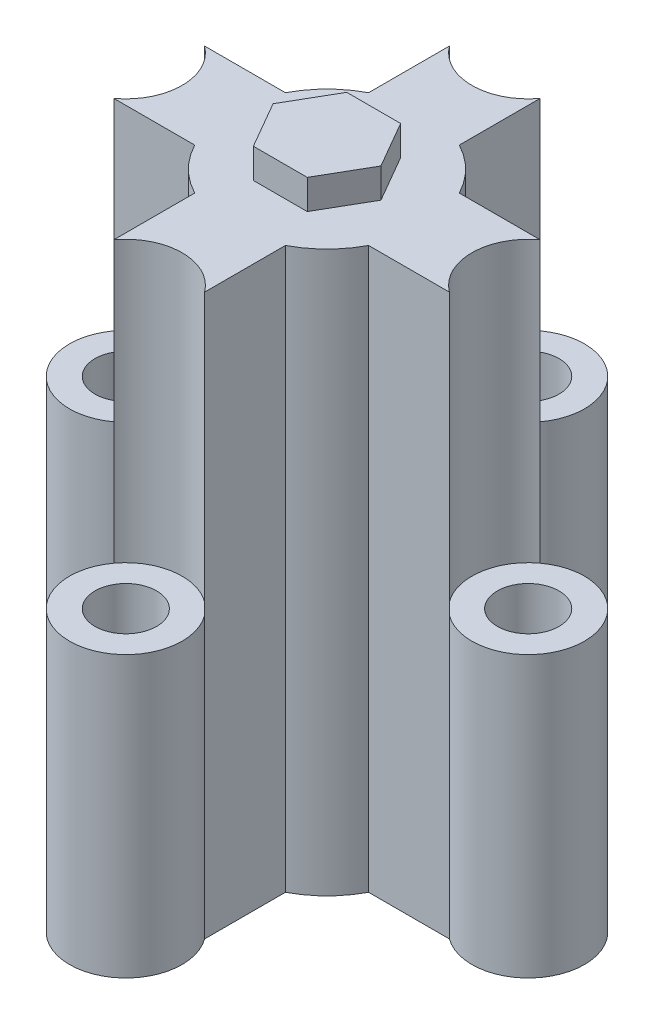
ISO-10303-21;
HEADER;
FILE_DESCRIPTION(('STEP AP214'),'2;1');
FILE_NAME('part.step','',(''),(''),'','','');
FILE_SCHEMA(('AUTOMOTIVE_DESIGN { 1 0 10303 214 1 1 1 1 }'));
ENDSEC;
DATA;
#1=APPLICATION_CONTEXT('core data for automotive mechanical design processes');
#2=APPLICATION_PROTOCOL_DEFINITION('international standard','automotive_design',2000,#1);
#3=PRODUCT_CONTEXT('',#1,'mechanical');
#4=PRODUCT('Part','Part','',(#3));
#5=PRODUCT_RELATED_PRODUCT_CATEGORY('part','',(#4));
#6=PRODUCT_DEFINITION_FORMATION('','',#4);
#7=PRODUCT_DEFINITION_CONTEXT('part definition',#1,'design');
#8=PRODUCT_DEFINITION('design','',#6,#7);
#9=PRODUCT_DEFINITION_SHAPE('','',#8);
#10=(LENGTH_UNIT() NAMED_UNIT(*) SI_UNIT(.MILLI.,.METRE.));
#11=(NAMED_UNIT(*) PLANE_ANGLE_UNIT() SI_UNIT($,.RADIAN.));
#12=(NAMED_UNIT(*) SI_UNIT($,.STERADIAN.) SOLID_ANGLE_UNIT());
#13=UNCERTAINTY_MEASURE_WITH_UNIT(LENGTH_MEASURE(1.E-05),#10,'distance_accuracy_value','');
#14=(GEOMETRIC_REPRESENTATION_CONTEXT(3) GLOBAL_UNCERTAINTY_ASSIGNED_CONTEXT((#13)) GLOBAL_UNIT_ASSIGNED_CONTEXT((#10,
#11,#12)) REPRESENTATION_CONTEXT('',''));
#15=CARTESIAN_POINT('',(0.,0.,0.));
#16=DIRECTION('',(0.,0.,1.));
#17=DIRECTION('',(1.,0.,0.));
#18=AXIS2_PLACEMENT_3D('',#15,#16,#17);
#19=CARTESIAN_POINT('',(-4.85829947999973,60.,0.));
#20=DIRECTION('',(1.,0.,0.));
#21=DIRECTION('',(0.,0.,-1.));
#22=AXIS2_PLACEMENT_3D('',#19,#20,#21);
#23=PLANE('',#22);
#24=DIRECTION('',(0.,0.,1.));
#25=VECTOR('',#24,1.);
#26=CARTESIAN_POINT('',(-4.85829947999973,0.,0.));
#27=LINE('',#26,#25);
#28=CARTESIAN_POINT('',(-4.85829947999973,0.,-17.9729348131197));
#29=VERTEX_POINT('',#28);
#30=CARTESIAN_POINT('',(-4.85829947999972,0.,-9.30843306698996));
#31=VERTEX_POINT('',#30);
#32=EDGE_CURVE('E403',#29,#31,#27,.T.);
#33=ORIENTED_EDGE('',*,*,#32,.T.);
#34=DIRECTION('',(0.,-1.,0.));
#35=VECTOR('',#34,1.);
#36=CARTESIAN_POINT('',(-4.85829947999972,60.,-9.30843306698996));
#37=LINE('',#36,#35);
#38=CARTESIAN_POINT('',(-4.85829947999972,60.,-9.30843306698996));
#39=VERTEX_POINT('',#38);
#40=EDGE_CURVE('E136',#39,#31,#37,.T.);
#41=ORIENTED_EDGE('',*,*,#40,.F.);
#42=DIRECTION('',(0.,0.,1.));
#43=VECTOR('',#42,1.);
#44=CARTESIAN_POINT('',(-4.85829947999973,60.,0.));
#45=LINE('',#44,#43);
#46=CARTESIAN_POINT('',(-4.85829947999973,60.,-17.9729348131197));
#47=VERTEX_POINT('',#46);
#48=EDGE_CURVE('E395',#47,#39,#45,.T.);
#49=ORIENTED_EDGE('',*,*,#48,.F.);
#50=DIRECTION('',(0.,-1.,0.));
#51=VECTOR('',#50,1.);
#52=CARTESIAN_POINT('',(-4.85829947999973,60.,-17.9729348131197));
#53=LINE('',#52,#51);
#54=CARTESIAN_POINT('',(-4.85829947999973,30.,-17.9729348131197));
#55=VERTEX_POINT('',#54);
#56=EDGE_CURVE('E12',#47,#55,#53,.T.);
#57=ORIENTED_EDGE('',*,*,#56,.T.);
#58=DIRECTION('',(0.,-1.,0.));
#59=VECTOR('',#58,1.);
#60=CARTESIAN_POINT('',(-4.85829947999973,30.,-17.9729348131197));
#61=LINE('',#60,#59);
#62=EDGE_CURVE('E374',#29,#55,#61,.F.);
#63=ORIENTED_EDGE('',*,*,#62,.F.);
#64=EDGE_LOOP('',(#33,#41,#49,#57,#63));
#65=FACE_BOUND('',#64,.T.);
#66=ADVANCED_FACE('F127',(#65),#23,.F.);
#67=CARTESIAN_POINT('',(4.85829948000028,60.,0.));
#68=DIRECTION('',(1.,0.,0.));
#69=DIRECTION('',(0.,0.,-1.));
#70=AXIS2_PLACEMENT_3D('',#67,#68,#69);
#71=PLANE('',#70);
#72=DIRECTION('',(0.,0.,1.));
#73=VECTOR('',#72,1.);
#74=CARTESIAN_POINT('',(4.85829948000028,0.,0.));
#75=LINE('',#74,#73);
#76=CARTESIAN_POINT('',(4.85829948000027,0.,-17.9729348131197));
#77=VERTEX_POINT('',#76);
#78=CARTESIAN_POINT('',(4.85829948000028,0.,-9.30843306698862));
#79=VERTEX_POINT('',#78);
#80=EDGE_CURVE('E396',#77,#79,#75,.T.);
#81=ORIENTED_EDGE('',*,*,#80,.F.);
#82=DIRECTION('',(0.,-1.,0.));
#83=VECTOR('',#82,1.);
#84=CARTESIAN_POINT('',(4.85829948000027,30.,-17.9729348131197));
#85=LINE('',#84,#83);
#86=CARTESIAN_POINT('',(4.85829948000027,30.,-17.9729348131197));
#87=VERTEX_POINT('',#86);
#88=EDGE_CURVE('E369',#77,#87,#85,.F.);
#89=ORIENTED_EDGE('',*,*,#88,.T.);
#90=DIRECTION('',(0.,-1.,0.));
#91=VECTOR('',#90,1.);
#92=CARTESIAN_POINT('',(4.85829948000027,60.,-17.9729348131197));
#93=LINE('',#92,#91);
#94=CARTESIAN_POINT('',(4.85829948000027,60.,-17.9729348131197));
#95=VERTEX_POINT('',#94);
#96=EDGE_CURVE('E402',#95,#87,#93,.T.);
#97=ORIENTED_EDGE('',*,*,#96,.F.);
#98=DIRECTION('',(0.,0.,1.));
#99=VECTOR('',#98,1.);
#100=CARTESIAN_POINT('',(4.85829948000028,60.,0.));
#101=LINE('',#100,#99);
#102=CARTESIAN_POINT('',(4.85829948000028,60.,-9.30843306698862));
#103=VERTEX_POINT('',#102);
#104=EDGE_CURVE('E399',#95,#103,#101,.T.);
#105=ORIENTED_EDGE('',*,*,#104,.T.);
#106=DIRECTION('',(0.,-1.,0.));
#107=VECTOR('',#106,1.);
#108=CARTESIAN_POINT('',(4.85829948000028,60.,-9.30843306698862));
#109=LINE('',#108,#107);
#110=EDGE_CURVE('E411',#103,#79,#109,.T.);
#111=ORIENTED_EDGE('',*,*,#110,.T.);
#112=EDGE_LOOP('',(#81,#89,#97,#105,#111));
#113=FACE_BOUND('',#112,.T.);
#114=ADVANCED_FACE('F564',(#113),#71,.T.);
#115=CARTESIAN_POINT('',(2.70338638737442E-13,60.,-21.5479999999997));
#116=DIRECTION('',(0.,-1.,0.));
#117=DIRECTION('',(0.,0.,-1.));
#118=AXIS2_PLACEMENT_3D('',#115,#116,#117);
#119=CYLINDRICAL_SURFACE('',#118,6.03192879001485);
#120=CARTESIAN_POINT('',(2.70338638737442E-13,30.,-21.5479999999997));
#121=DIRECTION('',(0.,1.,0.));
#122=DIRECTION('',(0.,0.,1.));
#123=AXIS2_PLACEMENT_3D('',#120,#121,#122);
#124=CIRCLE('',#123,6.03192879001485);
#125=EDGE_CURVE('E359',#55,#87,#124,.T.);
#126=ORIENTED_EDGE('',*,*,#125,.F.);
#127=ORIENTED_EDGE('',*,*,#56,.F.);
#128=CARTESIAN_POINT('',(2.70338638737442E-13,60.,-21.5479999999997));
#129=DIRECTION('',(0.,1.,0.));
#130=DIRECTION('',(0.,0.,1.));
#131=AXIS2_PLACEMENT_3D('',#128,#129,#130);
#132=CIRCLE('',#131,6.03192879001485);
#133=EDGE_CURVE('E392',#47,#95,#132,.T.);
#134=ORIENTED_EDGE('',*,*,#133,.T.);
#135=ORIENTED_EDGE('',*,*,#96,.T.);
#136=EDGE_LOOP('',(#126,#127,#134,#135));
#137=FACE_BOUND('',#136,.T.);
#138=ADVANCED_FACE('F554',(#137),#119,.F.);
#139=CARTESIAN_POINT('',(0.,0.,0.));
#140=DIRECTION('',(0.,1.,0.));
#141=DIRECTION('',(0.,0.,1.));
#142=AXIS2_PLACEMENT_3D('',#139,#140,#141);
#143=PLANE('',#142);
#144=ORIENTED_EDGE('',*,*,#32,.F.);
#145=CARTESIAN_POINT('',(2.70338638737442E-13,0.,-21.5479999999997));
#146=DIRECTION('',(0.,1.,0.));
#147=DIRECTION('',(0.,0.,1.));
#148=AXIS2_PLACEMENT_3D('',#145,#146,#147);
#149=CIRCLE('',#148,6.03192879001485);
#150=EDGE_CURVE('E360',#77,#29,#149,.T.);
#151=ORIENTED_EDGE('',*,*,#150,.F.);
#152=ORIENTED_EDGE('',*,*,#80,.T.);
#153=CARTESIAN_POINT('',(0.,0.,0.));
#154=DIRECTION('',(0.,1.,0.));
#155=DIRECTION('',(0.,0.,1.));
#156=AXIS2_PLACEMENT_3D('',#153,#154,#155);
#157=CIRCLE('',#156,10.5);
#158=CARTESIAN_POINT('',(9.30843306699024,0.,-4.85829948));
#159=VERTEX_POINT('',#158);
#160=EDGE_CURVE('E508',#159,#79,#157,.T.);
#161=ORIENTED_EDGE('',*,*,#160,.F.);
#162=DIRECTION('',(-1.,0.,0.));
#163=VECTOR('',#162,1.);
#164=CARTESIAN_POINT('',(0.,0.,-4.85829948));
#165=LINE('',#164,#163);
#166=CARTESIAN_POINT('',(17.9729348131204,0.,-4.85829948));
#167=VERTEX_POINT('',#166);
#168=EDGE_CURVE('E452',#167,#159,#165,.T.);
#169=ORIENTED_EDGE('',*,*,#168,.F.);
#170=CARTESIAN_POINT('',(21.548,0.,0.));
#171=DIRECTION('',(0.,1.,0.));
#172=DIRECTION('',(0.,0.,1.));
#173=AXIS2_PLACEMENT_3D('',#170,#171,#172);
#174=CIRCLE('',#173,6.03192879001457);
#175=CARTESIAN_POINT('',(17.9729348131204,0.,4.85829948));
#176=VERTEX_POINT('',#175);
#177=EDGE_CURVE('E380',#176,#167,#174,.T.);
#178=ORIENTED_EDGE('',*,*,#177,.F.);
#179=DIRECTION('',(-1.,0.,0.));
#180=VECTOR('',#179,1.);
#181=CARTESIAN_POINT('',(0.,0.,4.85829948));
#182=LINE('',#181,#180);
#183=CARTESIAN_POINT('',(9.3084330669889,0.,4.85829948));
#184=VERTEX_POINT('',#183);
#185=EDGE_CURVE('E445',#176,#184,#182,.T.);
#186=ORIENTED_EDGE('',*,*,#185,.T.);
#187=CARTESIAN_POINT('',(4.85829948000028,0.,9.30843306698996));
#188=VERTEX_POINT('',#187);
#189=EDGE_CURVE('E131',#188,#184,#157,.T.);
#190=ORIENTED_EDGE('',*,*,#189,.F.);
#191=DIRECTION('',(0.,0.,-1.));
#192=VECTOR('',#191,1.);
#193=CARTESIAN_POINT('',(4.85829948000028,0.,0.));
#194=LINE('',#193,#192);
#195=CARTESIAN_POINT('',(4.85829948000028,0.,17.9729348131199));
#196=VERTEX_POINT('',#195);
#197=EDGE_CURVE('E478',#196,#188,#194,.T.);
#198=ORIENTED_EDGE('',*,*,#197,.F.);
#199=CARTESIAN_POINT('',(2.82134004652334E-13,0.,21.5479999999997));
#200=DIRECTION('',(0.,1.,0.));
#201=DIRECTION('',(0.,0.,1.));
#202=AXIS2_PLACEMENT_3D('',#199,#200,#201);
#203=CIRCLE('',#202,6.03192879001472);
#204=CARTESIAN_POINT('',(-4.85829947999972,0.,17.9729348131199));
#205=VERTEX_POINT('',#204);
#206=EDGE_CURVE('E331',#205,#196,#203,.T.);
#207=ORIENTED_EDGE('',*,*,#206,.F.);
#208=DIRECTION('',(0.,0.,-1.));
#209=VECTOR('',#208,1.);
#210=CARTESIAN_POINT('',(-4.85829947999972,0.,0.));
#211=LINE('',#210,#209);
#212=CARTESIAN_POINT('',(-4.85829947999972,0.,9.30843306698863));
#213=VERTEX_POINT('',#212);
#214=EDGE_CURVE('E471',#205,#213,#211,.T.);
#215=ORIENTED_EDGE('',*,*,#214,.T.);
#216=CARTESIAN_POINT('',(-9.30843306698968,0.,4.85829948000001));
#217=VERTEX_POINT('',#216);
#218=EDGE_CURVE('E391',#217,#213,#157,.T.);
#219=ORIENTED_EDGE('',*,*,#218,.F.);
#220=DIRECTION('',(1.,0.,0.));
#221=VECTOR('',#220,1.);
#222=CARTESIAN_POINT('',(0.,0.,4.85829948000001));
#223=LINE('',#222,#221);
#224=CARTESIAN_POINT('',(-17.9729348131188,0.,4.85829948000001));
#225=VERTEX_POINT('',#224);
#226=EDGE_CURVE('E425',#225,#217,#223,.T.);
#227=ORIENTED_EDGE('',*,*,#226,.F.);
#228=CARTESIAN_POINT('',(-21.5479999999994,0.,0.));
#229=DIRECTION('',(0.,1.,0.));
#230=DIRECTION('',(0.,0.,1.));
#231=AXIS2_PLACEMENT_3D('',#228,#229,#230);
#232=CIRCLE('',#231,6.03192879001505);
#233=CARTESIAN_POINT('',(-17.972934813119,0.,-4.85829947999999));
#234=VERTEX_POINT('',#233);
#235=EDGE_CURVE('E344',#234,#225,#232,.T.);
#236=ORIENTED_EDGE('',*,*,#235,.F.);
#237=DIRECTION('',(1.,0.,0.));
#238=VECTOR('',#237,1.);
#239=CARTESIAN_POINT('',(0.,0.,-4.85829948));
#240=LINE('',#239,#238);
#241=CARTESIAN_POINT('',(-9.30843306698835,0.,-4.85829948));
#242=VERTEX_POINT('',#241);
#243=EDGE_CURVE('E418',#234,#242,#240,.T.);
#244=ORIENTED_EDGE('',*,*,#243,.T.);
#245=EDGE_CURVE('E509',#31,#242,#157,.T.);
#246=ORIENTED_EDGE('',*,*,#245,.F.);
#247=EDGE_LOOP('',(#144,#151,#152,#161,#169,#178,#186,#190,#198,#207,#215,#219,#227,#236,#244,#246));
#248=FACE_BOUND('',#247,.T.);
#249=CARTESIAN_POINT('',(21.548,0.,0.));
#250=DIRECTION('',(0.,1.,0.));
#251=DIRECTION('',(0.,0.,1.));
#252=AXIS2_PLACEMENT_3D('',#249,#250,#251);
#253=CIRCLE('',#252,3.302);
#254=CARTESIAN_POINT('',(21.548,0.,3.302));
#255=VERTEX_POINT('',#254);
#256=EDGE_CURVE('E376',#255,#255,#253,.T.);
#257=ORIENTED_EDGE('',*,*,#256,.T.);
#258=EDGE_LOOP('',(#257));
#259=FACE_BOUND('',#258,.T.);
#260=CARTESIAN_POINT('',(2.70338638737442E-13,0.,-21.5479999999997));
#261=DIRECTION('',(0.,1.,0.));
#262=DIRECTION('',(0.,0.,1.));
#263=AXIS2_PLACEMENT_3D('',#260,#261,#262);
#264=CIRCLE('',#263,3.30200000000028);
#265=CARTESIAN_POINT('',(2.70338638737442E-13,0.,-18.2459999999994));
#266=VERTEX_POINT('',#265);
#267=EDGE_CURVE('E366',#266,#266,#264,.T.);
#268=ORIENTED_EDGE('',*,*,#267,.T.);
#269=EDGE_LOOP('',(#268));
#270=FACE_BOUND('',#269,.T.);
#271=CARTESIAN_POINT('',(-21.5479999999994,0.,0.));
#272=DIRECTION('',(0.,1.,0.));
#273=DIRECTION('',(0.,0.,1.));
#274=AXIS2_PLACEMENT_3D('',#271,#272,#273);
#275=CIRCLE('',#274,3.30200000000048);
#276=CARTESIAN_POINT('',(-21.5479999999994,0.,3.30200000000049));
#277=VERTEX_POINT('',#276);
#278=EDGE_CURVE('E351',#277,#277,#275,.T.);
#279=ORIENTED_EDGE('',*,*,#278,.T.);
#280=EDGE_LOOP('',(#279));
#281=FACE_BOUND('',#280,.T.);
#282=CARTESIAN_POINT('',(2.82134004652334E-13,0.,21.5479999999997));
#283=DIRECTION('',(0.,1.,0.));
#284=DIRECTION('',(0.,0.,1.));
#285=AXIS2_PLACEMENT_3D('',#282,#283,#284);
#286=CIRCLE('',#285,3.30200000000016);
#287=CARTESIAN_POINT('',(2.82134004652334E-13,0.,24.8499999999999));
#288=VERTEX_POINT('',#287);
#289=EDGE_CURVE('E335',#288,#288,#286,.T.);
#290=ORIENTED_EDGE('',*,*,#289,.T.);
#291=EDGE_LOOP('',(#290));
#292=FACE_BOUND('',#291,.T.);
#293=ADVANCED_FACE('F525',(#248,#259,#270,#281,#292),#143,.F.);
#294=CARTESIAN_POINT('',(0.,60.,0.));
#295=DIRECTION('',(0.,1.,0.));
#296=DIRECTION('',(0.,0.,1.));
#297=AXIS2_PLACEMENT_3D('',#294,#295,#296);
#298=PLANE('',#297);
#299=DIRECTION('',(0.5,0.,-0.866025403784439));
#300=VECTOR('',#299,1.);
#301=CARTESIAN_POINT('',(2.88675134594813,60.,5.));
#302=LINE('',#301,#300);
#303=CARTESIAN_POINT('',(2.88675134594813,60.,5.));
#304=VERTEX_POINT('',#303);
#305=CARTESIAN_POINT('',(5.77350269189626,60.,0.));
#306=VERTEX_POINT('',#305);
#307=EDGE_CURVE('E144',#304,#306,#302,.T.);
#308=ORIENTED_EDGE('',*,*,#307,.F.);
#309=DIRECTION('',(1.,0.,0.));
#310=VECTOR('',#309,1.);
#311=CARTESIAN_POINT('',(-2.88675134594813,60.,5.));
#312=LINE('',#311,#310);
#313=CARTESIAN_POINT('',(-2.88675134594813,60.,5.));
#314=VERTEX_POINT('',#313);
#315=EDGE_CURVE('E148',#314,#304,#312,.T.);
#316=ORIENTED_EDGE('',*,*,#315,.F.);
#317=DIRECTION('',(0.5,0.,0.866025403784438));
#318=VECTOR('',#317,1.);
#319=CARTESIAN_POINT('',(-5.77350269189626,60.,0.));
#320=LINE('',#319,#318);
#321=CARTESIAN_POINT('',(-5.77350269189626,60.,0.));
#322=VERTEX_POINT('',#321);
#323=EDGE_CURVE('E817',#322,#314,#320,.T.);
#324=ORIENTED_EDGE('',*,*,#323,.F.);
#325=DIRECTION('',(-0.5,0.,0.866025403784439));
#326=VECTOR('',#325,1.);
#327=CARTESIAN_POINT('',(-2.88675134594813,60.,-5.));
#328=LINE('',#327,#326);
#329=CARTESIAN_POINT('',(-2.88675134594813,60.,-5.));
#330=VERTEX_POINT('',#329);
#331=EDGE_CURVE('E832',#330,#322,#328,.T.);
#332=ORIENTED_EDGE('',*,*,#331,.F.);
#333=DIRECTION('',(-1.,0.,0.));
#334=VECTOR('',#333,1.);
#335=CARTESIAN_POINT('',(2.88675134594813,60.,-5.00000000000001));
#336=LINE('',#335,#334);
#337=CARTESIAN_POINT('',(2.88675134594813,60.,-5.00000000000001));
#338=VERTEX_POINT('',#337);
#339=EDGE_CURVE('E835',#338,#330,#336,.T.);
#340=ORIENTED_EDGE('',*,*,#339,.F.);
#341=DIRECTION('',(-0.5,0.,-0.866025403784439));
#342=VECTOR('',#341,1.);
#343=CARTESIAN_POINT('',(5.77350269189626,60.,0.));
#344=LINE('',#343,#342);
#345=EDGE_CURVE('E836',#306,#338,#344,.T.);
#346=ORIENTED_EDGE('',*,*,#345,.F.);
#347=EDGE_LOOP('',(#308,#316,#324,#332,#340,#346));
#348=FACE_BOUND('',#347,.T.);
#349=ORIENTED_EDGE('',*,*,#133,.F.);
#350=ORIENTED_EDGE('',*,*,#48,.T.);
#351=CARTESIAN_POINT('',(0.,60.,0.));
#352=DIRECTION('',(0.,1.,0.));
#353=DIRECTION('',(0.,0.,1.));
#354=AXIS2_PLACEMENT_3D('',#351,#352,#353);
#355=CIRCLE('',#354,10.5);
#356=CARTESIAN_POINT('',(-9.30843306698835,60.,-4.85829948));
#357=VERTEX_POINT('',#356);
#358=EDGE_CURVE('E495',#39,#357,#355,.T.);
#359=ORIENTED_EDGE('',*,*,#358,.T.);
#360=DIRECTION('',(1.,0.,0.));
#361=VECTOR('',#360,1.);
#362=CARTESIAN_POINT('',(0.,60.,-4.85829948));
#363=LINE('',#362,#361);
#364=CARTESIAN_POINT('',(-17.9729348131188,60.,-4.85829947999999));
#365=VERTEX_POINT('',#364);
#366=EDGE_CURVE('E421',#365,#357,#363,.T.);
#367=ORIENTED_EDGE('',*,*,#366,.F.);
#368=CARTESIAN_POINT('',(-21.5479999999994,60.,0.));
#369=DIRECTION('',(0.,1.,0.));
#370=DIRECTION('',(0.,0.,1.));
#371=AXIS2_PLACEMENT_3D('',#368,#369,#370);
#372=CIRCLE('',#371,6.03192879001505);
#373=CARTESIAN_POINT('',(-17.9729348131188,60.,4.85829948000001));
#374=VERTEX_POINT('',#373);
#375=EDGE_CURVE('E414',#374,#365,#372,.T.);
#376=ORIENTED_EDGE('',*,*,#375,.F.);
#377=DIRECTION('',(1.,0.,0.));
#378=VECTOR('',#377,1.);
#379=CARTESIAN_POINT('',(0.,60.,4.85829948000001));
#380=LINE('',#379,#378);
#381=CARTESIAN_POINT('',(-9.30843306698968,60.,4.85829948000001));
#382=VERTEX_POINT('',#381);
#383=EDGE_CURVE('E417',#374,#382,#380,.T.);
#384=ORIENTED_EDGE('',*,*,#383,.T.);
#385=CARTESIAN_POINT('',(-4.85829947999972,60.,9.30843306698863));
#386=VERTEX_POINT('',#385);
#387=EDGE_CURVE('E500',#382,#386,#355,.T.);
#388=ORIENTED_EDGE('',*,*,#387,.T.);
#389=DIRECTION('',(0.,0.,-1.));
#390=VECTOR('',#389,1.);
#391=CARTESIAN_POINT('',(-4.85829947999972,60.,0.));
#392=LINE('',#391,#390);
#393=CARTESIAN_POINT('',(-4.85829947999972,60.,17.9729348131199));
#394=VERTEX_POINT('',#393);
#395=EDGE_CURVE('E474',#394,#386,#392,.T.);
#396=ORIENTED_EDGE('',*,*,#395,.F.);
#397=CARTESIAN_POINT('',(2.82134004652334E-13,60.,21.5479999999997));
#398=DIRECTION('',(0.,1.,0.));
#399=DIRECTION('',(0.,0.,1.));
#400=AXIS2_PLACEMENT_3D('',#397,#398,#399);
#401=CIRCLE('',#400,6.03192879001472);
#402=CARTESIAN_POINT('',(4.85829948000028,60.,17.9729348131199));
#403=VERTEX_POINT('',#402);
#404=EDGE_CURVE('E467',#403,#394,#401,.T.);
#405=ORIENTED_EDGE('',*,*,#404,.F.);
#406=DIRECTION('',(0.,0.,-1.));
#407=VECTOR('',#406,1.);
#408=CARTESIAN_POINT('',(4.85829948000028,60.,0.));
#409=LINE('',#408,#407);
#410=CARTESIAN_POINT('',(4.85829948000028,60.,9.30843306698996));
#411=VERTEX_POINT('',#410);
#412=EDGE_CURVE('E470',#403,#411,#409,.T.);
#413=ORIENTED_EDGE('',*,*,#412,.T.);
#414=CARTESIAN_POINT('',(9.3084330669889,60.,4.85829948));
#415=VERTEX_POINT('',#414);
#416=EDGE_CURVE('E481',#411,#415,#355,.T.);
#417=ORIENTED_EDGE('',*,*,#416,.T.);
#418=DIRECTION('',(-1.,0.,0.));
#419=VECTOR('',#418,1.);
#420=CARTESIAN_POINT('',(0.,60.,4.85829948));
#421=LINE('',#420,#419);
#422=CARTESIAN_POINT('',(17.9729348131204,60.,4.85829948));
#423=VERTEX_POINT('',#422);
#424=EDGE_CURVE('E448',#423,#415,#421,.T.);
#425=ORIENTED_EDGE('',*,*,#424,.F.);
#426=CARTESIAN_POINT('',(21.548,60.,0.));
#427=DIRECTION('',(0.,1.,0.));
#428=DIRECTION('',(0.,0.,1.));
#429=AXIS2_PLACEMENT_3D('',#426,#427,#428);
#430=CIRCLE('',#429,6.03192879001457);
#431=CARTESIAN_POINT('',(17.9729348131204,60.,-4.85829948));
#432=VERTEX_POINT('',#431);
#433=EDGE_CURVE('E441',#432,#423,#430,.T.);
#434=ORIENTED_EDGE('',*,*,#433,.F.);
#435=DIRECTION('',(-1.,0.,0.));
#436=VECTOR('',#435,1.);
#437=CARTESIAN_POINT('',(0.,60.,-4.85829948));
#438=LINE('',#437,#436);
#439=CARTESIAN_POINT('',(9.30843306699024,60.,-4.85829948));
#440=VERTEX_POINT('',#439);
#441=EDGE_CURVE('E444',#432,#440,#438,.T.);
#442=ORIENTED_EDGE('',*,*,#441,.T.);
#443=EDGE_CURVE('E494',#440,#103,#355,.T.);
#444=ORIENTED_EDGE('',*,*,#443,.T.);
#445=ORIENTED_EDGE('',*,*,#104,.F.);
#446=EDGE_LOOP('',(#349,#350,#359,#367,#376,#384,#388,#396,#405,#413,#417,#425,#434,#442,#444,#445));
#447=FACE_BOUND('',#446,.T.);
#448=ADVANCED_FACE('F553',(#348,#447),#298,.T.);
#449=CARTESIAN_POINT('',(21.548,60.,0.));
#450=DIRECTION('',(0.,-1.,0.));
#451=DIRECTION('',(0.,0.,-1.));
#452=AXIS2_PLACEMENT_3D('',#449,#450,#451);
#453=CYLINDRICAL_SURFACE('',#452,6.03192879001457);
#454=CARTESIAN_POINT('',(21.548,30.,0.));
#455=DIRECTION('',(0.,1.,0.));
#456=DIRECTION('',(0.,0.,1.));
#457=AXIS2_PLACEMENT_3D('',#454,#455,#456);
#458=CIRCLE('',#457,6.03192879001457);
#459=CARTESIAN_POINT('',(17.9729348131204,30.,-4.85829948));
#460=VERTEX_POINT('',#459);
#461=CARTESIAN_POINT('',(17.9729348131204,30.,4.85829948));
#462=VERTEX_POINT('',#461);
#463=EDGE_CURVE('E383',#460,#462,#458,.T.);
#464=ORIENTED_EDGE('',*,*,#463,.F.);
#465=DIRECTION('',(0.,-1.,0.));
#466=VECTOR('',#465,1.);
#467=CARTESIAN_POINT('',(17.9729348131204,60.,-4.85829948));
#468=LINE('',#467,#466);
#469=EDGE_CURVE('E428',#432,#460,#468,.T.);
#470=ORIENTED_EDGE('',*,*,#469,.F.);
#471=ORIENTED_EDGE('',*,*,#433,.T.);
#472=DIRECTION('',(0.,-1.,0.));
#473=VECTOR('',#472,1.);
#474=CARTESIAN_POINT('',(17.9729348131204,60.,4.85829948));
#475=LINE('',#474,#473);
#476=EDGE_CURVE('E451',#423,#462,#475,.T.);
#477=ORIENTED_EDGE('',*,*,#476,.T.);
#478=EDGE_LOOP('',(#464,#470,#471,#477));
#479=FACE_BOUND('',#478,.T.);
#480=ADVANCED_FACE('F561',(#479),#453,.F.);
#481=CARTESIAN_POINT('',(-21.5479999999994,60.,0.));
#482=DIRECTION('',(0.,-1.,0.));
#483=DIRECTION('',(0.,0.,-1.));
#484=AXIS2_PLACEMENT_3D('',#481,#482,#483);
#485=CYLINDRICAL_SURFACE('',#484,6.03192879001505);
#486=CARTESIAN_POINT('',(-21.5479999999994,30.,0.));
#487=DIRECTION('',(0.,1.,0.));
#488=DIRECTION('',(0.,0.,1.));
#489=AXIS2_PLACEMENT_3D('',#486,#487,#488);
#490=CIRCLE('',#489,6.03192879001505);
#491=CARTESIAN_POINT('',(-17.9729348131188,30.,4.85829948000001));
#492=VERTEX_POINT('',#491);
#493=CARTESIAN_POINT('',(-17.9729348131188,30.,-4.85829947999999));
#494=VERTEX_POINT('',#493);
#495=EDGE_CURVE('E348',#492,#494,#490,.T.);
#496=ORIENTED_EDGE('',*,*,#495,.F.);
#497=DIRECTION('',(0.,-1.,0.));
#498=VECTOR('',#497,1.);
#499=CARTESIAN_POINT('',(-17.9729348131188,60.,4.85829948000001));
#500=LINE('',#499,#498);
#501=EDGE_CURVE('E406',#374,#492,#500,.T.);
#502=ORIENTED_EDGE('',*,*,#501,.F.);
#503=ORIENTED_EDGE('',*,*,#375,.T.);
#504=DIRECTION('',(0.,-1.,0.));
#505=VECTOR('',#504,1.);
#506=CARTESIAN_POINT('',(-17.9729348131188,60.,-4.85829947999999));
#507=LINE('',#506,#505);
#508=EDGE_CURVE('E431',#365,#494,#507,.T.);
#509=ORIENTED_EDGE('',*,*,#508,.T.);
#510=EDGE_LOOP('',(#496,#502,#503,#509));
#511=FACE_BOUND('',#510,.T.);
#512=ADVANCED_FACE('F583',(#511),#485,.F.);
#513=CARTESIAN_POINT('',(0.,60.,4.85829948000001));
#514=DIRECTION('',(0.,0.,-1.));
#515=DIRECTION('',(-1.,0.,0.));
#516=AXIS2_PLACEMENT_3D('',#513,#514,#515);
#517=PLANE('',#516);
#518=ORIENTED_EDGE('',*,*,#226,.T.);
#519=DIRECTION('',(0.,-1.,0.));
#520=VECTOR('',#519,1.);
#521=CARTESIAN_POINT('',(-9.30843306698968,60.,4.85829948000001));
#522=LINE('',#521,#520);
#523=EDGE_CURVE('E437',#382,#217,#522,.T.);
#524=ORIENTED_EDGE('',*,*,#523,.F.);
#525=ORIENTED_EDGE('',*,*,#383,.F.);
#526=ORIENTED_EDGE('',*,*,#501,.T.);
#527=DIRECTION('',(0.,-1.,0.));
#528=VECTOR('',#527,1.);
#529=CARTESIAN_POINT('',(-17.972934813119,30.,4.85829948000001));
#530=LINE('',#529,#528);
#531=EDGE_CURVE('E354',#225,#492,#530,.F.);
#532=ORIENTED_EDGE('',*,*,#531,.F.);
#533=EDGE_LOOP('',(#518,#524,#525,#526,#532));
#534=FACE_BOUND('',#533,.T.);
#535=ADVANCED_FACE('F584',(#534),#517,.F.);
#536=CARTESIAN_POINT('',(-4.85829947999972,60.,0.));
#537=DIRECTION('',(-1.,0.,0.));
#538=DIRECTION('',(0.,0.,1.));
#539=AXIS2_PLACEMENT_3D('',#536,#537,#538);
#540=PLANE('',#539);
#541=ORIENTED_EDGE('',*,*,#214,.F.);
#542=DIRECTION('',(0.,-1.,0.));
#543=VECTOR('',#542,1.);
#544=CARTESIAN_POINT('',(-4.85829947999972,30.,17.9729348131199));
#545=LINE('',#544,#543);
#546=CARTESIAN_POINT('',(-4.85829947999972,30.,17.9729348131199));
#547=VERTEX_POINT('',#546);
#548=EDGE_CURVE('E338',#205,#547,#545,.F.);
#549=ORIENTED_EDGE('',*,*,#548,.T.);
#550=DIRECTION('',(0.,-1.,0.));
#551=VECTOR('',#550,1.);
#552=CARTESIAN_POINT('',(-4.85829947999972,60.,17.9729348131199));
#553=LINE('',#552,#551);
#554=EDGE_CURVE('E477',#394,#547,#553,.T.);
#555=ORIENTED_EDGE('',*,*,#554,.F.);
#556=ORIENTED_EDGE('',*,*,#395,.T.);
#557=DIRECTION('',(0.,-1.,0.));
#558=VECTOR('',#557,1.);
#559=CARTESIAN_POINT('',(-4.85829947999972,60.,9.30843306698863));
#560=LINE('',#559,#558);
#561=EDGE_CURVE('E486',#386,#213,#560,.T.);
#562=ORIENTED_EDGE('',*,*,#561,.T.);
#563=EDGE_LOOP('',(#541,#549,#555,#556,#562));
#564=FACE_BOUND('',#563,.T.);
#565=ADVANCED_FACE('F522',(#564),#540,.T.);
#566=CARTESIAN_POINT('',(2.82134004652334E-13,60.,21.5479999999997));
#567=DIRECTION('',(0.,-1.,0.));
#568=DIRECTION('',(0.,0.,-1.));
#569=AXIS2_PLACEMENT_3D('',#566,#567,#568);
#570=CYLINDRICAL_SURFACE('',#569,6.03192879001472);
#571=CARTESIAN_POINT('',(2.82134004652334E-13,30.,21.5479999999997));
#572=DIRECTION('',(0.,1.,0.));
#573=DIRECTION('',(0.,0.,1.));
#574=AXIS2_PLACEMENT_3D('',#571,#572,#573);
#575=CIRCLE('',#574,6.03192879001472);
#576=CARTESIAN_POINT('',(4.85829948000028,30.,17.9729348131199));
#577=VERTEX_POINT('',#576);
#578=EDGE_CURVE('E325',#577,#547,#575,.T.);
#579=ORIENTED_EDGE('',*,*,#578,.F.);
#580=DIRECTION('',(0.,-1.,0.));
#581=VECTOR('',#580,1.);
#582=CARTESIAN_POINT('',(4.85829948000028,60.,17.9729348131199));
#583=LINE('',#582,#581);
#584=EDGE_CURVE('E455',#403,#577,#583,.T.);
#585=ORIENTED_EDGE('',*,*,#584,.F.);
#586=ORIENTED_EDGE('',*,*,#404,.T.);
#587=ORIENTED_EDGE('',*,*,#554,.T.);
#588=EDGE_LOOP('',(#579,#585,#586,#587));
#589=FACE_BOUND('',#588,.T.);
#590=ADVANCED_FACE('F537',(#589),#570,.F.);
#591=CARTESIAN_POINT('',(4.85829948000028,60.,0.));
#592=DIRECTION('',(-1.,0.,0.));
#593=DIRECTION('',(0.,0.,1.));
#594=AXIS2_PLACEMENT_3D('',#591,#592,#593);
#595=PLANE('',#594);
#596=ORIENTED_EDGE('',*,*,#197,.T.);
#597=DIRECTION('',(0.,-1.,0.));
#598=VECTOR('',#597,1.);
#599=CARTESIAN_POINT('',(4.85829948000028,60.,9.30843306698996));
#600=LINE('',#599,#598);
#601=EDGE_CURVE('E489',#411,#188,#600,.T.);
#602=ORIENTED_EDGE('',*,*,#601,.F.);
#603=ORIENTED_EDGE('',*,*,#412,.F.);
#604=ORIENTED_EDGE('',*,*,#584,.T.);
#605=EDGE_CURVE('E491',#577,#196,#583,.T.);
#606=ORIENTED_EDGE('',*,*,#605,.T.);
#607=EDGE_LOOP('',(#596,#602,#603,#604,#606));
#608=FACE_BOUND('',#607,.T.);
#609=ADVANCED_FACE('F532',(#608),#595,.F.);
#610=CARTESIAN_POINT('',(0.,60.,4.85829948));
#611=DIRECTION('',(0.,0.,1.));
#612=DIRECTION('',(1.,0.,0.));
#613=AXIS2_PLACEMENT_3D('',#610,#611,#612);
#614=PLANE('',#613);
#615=ORIENTED_EDGE('',*,*,#185,.F.);
#616=DIRECTION('',(0.,-1.,0.));
#617=VECTOR('',#616,1.);
#618=CARTESIAN_POINT('',(17.9729348131204,30.,4.85829948));
#619=LINE('',#618,#617);
#620=EDGE_CURVE('E386',#176,#462,#619,.F.);
#621=ORIENTED_EDGE('',*,*,#620,.T.);
#622=ORIENTED_EDGE('',*,*,#476,.F.);
#623=ORIENTED_EDGE('',*,*,#424,.T.);
#624=DIRECTION('',(0.,-1.,0.));
#625=VECTOR('',#624,1.);
#626=CARTESIAN_POINT('',(9.3084330669889,60.,4.85829948));
#627=LINE('',#626,#625);
#628=EDGE_CURVE('E460',#415,#184,#627,.T.);
#629=ORIENTED_EDGE('',*,*,#628,.T.);
#630=EDGE_LOOP('',(#615,#621,#622,#623,#629));
#631=FACE_BOUND('',#630,.T.);
#632=ADVANCED_FACE('F581',(#631),#614,.T.);
#633=CARTESIAN_POINT('',(0.,60.,-4.85829948));
#634=DIRECTION('',(0.,0.,-1.));
#635=DIRECTION('',(-1.,0.,0.));
#636=AXIS2_PLACEMENT_3D('',#633,#634,#635);
#637=PLANE('',#636);
#638=ORIENTED_EDGE('',*,*,#243,.F.);
#639=EDGE_CURVE('E424',#494,#234,#507,.T.);
#640=ORIENTED_EDGE('',*,*,#639,.F.);
#641=ORIENTED_EDGE('',*,*,#508,.F.);
#642=ORIENTED_EDGE('',*,*,#366,.T.);
#643=DIRECTION('',(0.,-1.,0.));
#644=VECTOR('',#643,1.);
#645=CARTESIAN_POINT('',(-9.30843306698835,60.,-4.85829948));
#646=LINE('',#645,#644);
#647=EDGE_CURVE('E434',#357,#242,#646,.T.);
#648=ORIENTED_EDGE('',*,*,#647,.T.);
#649=EDGE_LOOP('',(#638,#640,#641,#642,#648));
#650=FACE_BOUND('',#649,.T.);
#651=ADVANCED_FACE('F577',(#650),#637,.T.);
#652=CARTESIAN_POINT('',(0.,60.,-4.85829948));
#653=DIRECTION('',(0.,0.,1.));
#654=DIRECTION('',(1.,0.,0.));
#655=AXIS2_PLACEMENT_3D('',#652,#653,#654);
#656=PLANE('',#655);
#657=ORIENTED_EDGE('',*,*,#168,.T.);
#658=DIRECTION('',(0.,-1.,0.));
#659=VECTOR('',#658,1.);
#660=CARTESIAN_POINT('',(9.30843306699024,60.,-4.85829948));
#661=LINE('',#660,#659);
#662=EDGE_CURVE('E462',#440,#159,#661,.T.);
#663=ORIENTED_EDGE('',*,*,#662,.F.);
#664=ORIENTED_EDGE('',*,*,#441,.F.);
#665=ORIENTED_EDGE('',*,*,#469,.T.);
#666=EDGE_CURVE('E464',#460,#167,#468,.T.);
#667=ORIENTED_EDGE('',*,*,#666,.T.);
#668=EDGE_LOOP('',(#657,#663,#664,#665,#667));
#669=FACE_BOUND('',#668,.T.);
#670=ADVANCED_FACE('F580',(#669),#656,.F.);
#671=CARTESIAN_POINT('',(0.,60.,0.));
#672=DIRECTION('',(0.,-1.,0.));
#673=DIRECTION('',(0.,0.,-1.));
#674=AXIS2_PLACEMENT_3D('',#671,#672,#673);
#675=CYLINDRICAL_SURFACE('',#674,10.5);
#676=ORIENTED_EDGE('',*,*,#110,.F.);
#677=ORIENTED_EDGE('',*,*,#443,.F.);
#678=ORIENTED_EDGE('',*,*,#662,.T.);
#679=ORIENTED_EDGE('',*,*,#160,.T.);
#680=EDGE_LOOP('',(#676,#677,#678,#679));
#681=FACE_BOUND('',#680,.T.);
#682=ADVANCED_FACE('F596',(#681),#675,.T.);
#683=ORIENTED_EDGE('',*,*,#358,.F.);
#684=ORIENTED_EDGE('',*,*,#40,.T.);
#685=ORIENTED_EDGE('',*,*,#245,.T.);
#686=ORIENTED_EDGE('',*,*,#647,.F.);
#687=EDGE_LOOP('',(#683,#684,#685,#686));
#688=FACE_BOUND('',#687,.T.);
#689=ADVANCED_FACE('F563',(#688),#675,.T.);
#690=ORIENTED_EDGE('',*,*,#387,.F.);
#691=ORIENTED_EDGE('',*,*,#523,.T.);
#692=ORIENTED_EDGE('',*,*,#218,.T.);
#693=ORIENTED_EDGE('',*,*,#561,.F.);
#694=EDGE_LOOP('',(#690,#691,#692,#693));
#695=FACE_BOUND('',#694,.T.);
#696=ADVANCED_FACE('F517',(#695),#675,.T.);
#697=ORIENTED_EDGE('',*,*,#628,.F.);
#698=ORIENTED_EDGE('',*,*,#416,.F.);
#699=ORIENTED_EDGE('',*,*,#601,.T.);
#700=ORIENTED_EDGE('',*,*,#189,.T.);
#701=EDGE_LOOP('',(#697,#698,#699,#700));
#702=FACE_BOUND('',#701,.T.);
#703=ADVANCED_FACE('F129',(#702),#675,.T.);
#704=CARTESIAN_POINT('',(21.548,30.,0.));
#705=DIRECTION('',(0.,1.,0.));
#706=DIRECTION('',(0.,0.,1.));
#707=AXIS2_PLACEMENT_3D('',#704,#705,#706);
#708=PLANE('',#707);
#709=ORIENTED_EDGE('',*,*,#463,.T.);
#710=EDGE_CURVE('E387',#462,#460,#458,.T.);
#711=ORIENTED_EDGE('',*,*,#710,.T.);
#712=EDGE_LOOP('',(#709,#711));
#713=FACE_BOUND('',#712,.T.);
#714=CARTESIAN_POINT('',(21.548,30.,0.));
#715=DIRECTION('',(0.,1.,0.));
#716=DIRECTION('',(0.,0.,1.));
#717=AXIS2_PLACEMENT_3D('',#714,#715,#716);
#718=CIRCLE('',#717,3.302);
#719=CARTESIAN_POINT('',(21.548,30.,3.302));
#720=VERTEX_POINT('',#719);
#721=EDGE_CURVE('E377',#720,#720,#718,.T.);
#722=ORIENTED_EDGE('',*,*,#721,.F.);
#723=EDGE_LOOP('',(#722));
#724=FACE_BOUND('',#723,.T.);
#725=ADVANCED_FACE('F606',(#713,#724),#708,.T.);
#726=CARTESIAN_POINT('',(21.548,30.,0.));
#727=DIRECTION('',(0.,-1.,0.));
#728=DIRECTION('',(0.,0.,-1.));
#729=AXIS2_PLACEMENT_3D('',#726,#727,#728);
#730=CYLINDRICAL_SURFACE('',#729,6.03192879001457);
#731=ORIENTED_EDGE('',*,*,#620,.F.);
#732=ORIENTED_EDGE('',*,*,#177,.T.);
#733=ORIENTED_EDGE('',*,*,#666,.F.);
#734=ORIENTED_EDGE('',*,*,#710,.F.);
#735=EDGE_LOOP('',(#731,#732,#733,#734));
#736=FACE_BOUND('',#735,.T.);
#737=ADVANCED_FACE('F611',(#736),#730,.T.);
#738=CARTESIAN_POINT('',(21.548,30.,0.));
#739=DIRECTION('',(0.,-1.,0.));
#740=DIRECTION('',(0.,0.,-1.));
#741=AXIS2_PLACEMENT_3D('',#738,#739,#740);
#742=CYLINDRICAL_SURFACE('',#741,3.302);
#743=ORIENTED_EDGE('',*,*,#721,.T.);
#744=EDGE_LOOP('',(#743));
#745=FACE_BOUND('',#744,.T.);
#746=ORIENTED_EDGE('',*,*,#256,.F.);
#747=EDGE_LOOP('',(#746));
#748=FACE_BOUND('',#747,.T.);
#749=ADVANCED_FACE('F669',(#745,#748),#742,.F.);
#750=CARTESIAN_POINT('',(2.70338638737442E-13,30.,-21.5479999999997));
#751=DIRECTION('',(0.,-1.,0.));
#752=DIRECTION('',(0.,0.,-1.));
#753=AXIS2_PLACEMENT_3D('',#750,#751,#752);
#754=CYLINDRICAL_SURFACE('',#753,6.03192879001485);
#755=ORIENTED_EDGE('',*,*,#150,.T.);
#756=ORIENTED_EDGE('',*,*,#62,.T.);
#757=EDGE_CURVE('E363',#87,#55,#124,.T.);
#758=ORIENTED_EDGE('',*,*,#757,.F.);
#759=ORIENTED_EDGE('',*,*,#88,.F.);
#760=EDGE_LOOP('',(#755,#756,#758,#759));
#761=FACE_BOUND('',#760,.T.);
#762=ADVANCED_FACE('F640',(#761),#754,.T.);
#763=CARTESIAN_POINT('',(2.70338638737442E-13,30.,-21.5479999999997));
#764=DIRECTION('',(0.,1.,0.));
#765=DIRECTION('',(0.,0.,1.));
#766=AXIS2_PLACEMENT_3D('',#763,#764,#765);
#767=PLANE('',#766);
#768=ORIENTED_EDGE('',*,*,#757,.T.);
#769=ORIENTED_EDGE('',*,*,#125,.T.);
#770=EDGE_LOOP('',(#768,#769));
#771=FACE_BOUND('',#770,.T.);
#772=CARTESIAN_POINT('',(2.70338638737442E-13,30.,-21.5479999999997));
#773=DIRECTION('',(0.,1.,0.));
#774=DIRECTION('',(0.,0.,1.));
#775=AXIS2_PLACEMENT_3D('',#772,#773,#774);
#776=CIRCLE('',#775,3.30200000000028);
#777=CARTESIAN_POINT('',(2.70338638737442E-13,30.,-18.2459999999994));
#778=VERTEX_POINT('',#777);
#779=EDGE_CURVE('E362',#778,#778,#776,.T.);
#780=ORIENTED_EDGE('',*,*,#779,.F.);
#781=EDGE_LOOP('',(#780));
#782=FACE_BOUND('',#781,.T.);
#783=ADVANCED_FACE('F642',(#771,#782),#767,.T.);
#784=CARTESIAN_POINT('',(2.70338638737442E-13,30.,-21.5479999999997));
#785=DIRECTION('',(0.,-1.,0.));
#786=DIRECTION('',(0.,0.,-1.));
#787=AXIS2_PLACEMENT_3D('',#784,#785,#786);
#788=CYLINDRICAL_SURFACE('',#787,3.30200000000028);
#789=ORIENTED_EDGE('',*,*,#779,.T.);
#790=EDGE_LOOP('',(#789));
#791=FACE_BOUND('',#790,.T.);
#792=ORIENTED_EDGE('',*,*,#267,.F.);
#793=EDGE_LOOP('',(#792));
#794=FACE_BOUND('',#793,.T.);
#795=ADVANCED_FACE('F645',(#791,#794),#788,.F.);
#796=CARTESIAN_POINT('',(-21.5479999999994,30.,0.));
#797=DIRECTION('',(0.,-1.,0.));
#798=DIRECTION('',(0.,0.,-1.));
#799=AXIS2_PLACEMENT_3D('',#796,#797,#798);
#800=CYLINDRICAL_SURFACE('',#799,6.03192879001505);
#801=ORIENTED_EDGE('',*,*,#235,.T.);
#802=ORIENTED_EDGE('',*,*,#531,.T.);
#803=EDGE_CURVE('E343',#494,#492,#490,.T.);
#804=ORIENTED_EDGE('',*,*,#803,.F.);
#805=ORIENTED_EDGE('',*,*,#639,.T.);
#806=EDGE_LOOP('',(#801,#802,#804,#805));
#807=FACE_BOUND('',#806,.T.);
#808=ADVANCED_FACE('F636',(#807),#800,.T.);
#809=CARTESIAN_POINT('',(-21.5479999999994,30.,0.));
#810=DIRECTION('',(0.,1.,0.));
#811=DIRECTION('',(0.,0.,1.));
#812=AXIS2_PLACEMENT_3D('',#809,#810,#811);
#813=PLANE('',#812);
#814=ORIENTED_EDGE('',*,*,#495,.T.);
#815=ORIENTED_EDGE('',*,*,#803,.T.);
#816=EDGE_LOOP('',(#814,#815));
#817=FACE_BOUND('',#816,.T.);
#818=CARTESIAN_POINT('',(-21.5479999999994,30.,0.));
#819=DIRECTION('',(0.,1.,0.));
#820=DIRECTION('',(0.,0.,1.));
#821=AXIS2_PLACEMENT_3D('',#818,#819,#820);
#822=CIRCLE('',#821,3.30200000000048);
#823=CARTESIAN_POINT('',(-21.5479999999994,30.,3.30200000000049));
#824=VERTEX_POINT('',#823);
#825=EDGE_CURVE('E347',#824,#824,#822,.T.);
#826=ORIENTED_EDGE('',*,*,#825,.F.);
#827=EDGE_LOOP('',(#826));
#828=FACE_BOUND('',#827,.T.);
#829=ADVANCED_FACE('F658',(#817,#828),#813,.T.);
#830=CARTESIAN_POINT('',(-21.5479999999994,30.,0.));
#831=DIRECTION('',(0.,-1.,0.));
#832=DIRECTION('',(0.,0.,-1.));
#833=AXIS2_PLACEMENT_3D('',#830,#831,#832);
#834=CYLINDRICAL_SURFACE('',#833,3.30200000000048);
#835=ORIENTED_EDGE('',*,*,#825,.T.);
#836=EDGE_LOOP('',(#835));
#837=FACE_BOUND('',#836,.T.);
#838=ORIENTED_EDGE('',*,*,#278,.F.);
#839=EDGE_LOOP('',(#838));
#840=FACE_BOUND('',#839,.T.);
#841=ADVANCED_FACE('F542',(#837,#840),#834,.F.);
#842=CARTESIAN_POINT('',(2.82134004652334E-13,30.,21.5479999999997));
#843=DIRECTION('',(0.,1.,0.));
#844=DIRECTION('',(0.,0.,1.));
#845=AXIS2_PLACEMENT_3D('',#842,#843,#844);
#846=PLANE('',#845);
#847=ORIENTED_EDGE('',*,*,#578,.T.);
#848=EDGE_CURVE('E322',#547,#577,#575,.T.);
#849=ORIENTED_EDGE('',*,*,#848,.T.);
#850=EDGE_LOOP('',(#847,#849));
#851=FACE_BOUND('',#850,.T.);
#852=CARTESIAN_POINT('',(2.82134004652334E-13,30.,21.5479999999997));
#853=DIRECTION('',(0.,1.,0.));
#854=DIRECTION('',(0.,0.,1.));
#855=AXIS2_PLACEMENT_3D('',#852,#853,#854);
#856=CIRCLE('',#855,3.30200000000016);
#857=CARTESIAN_POINT('',(2.82134004652334E-13,30.,24.8499999999999));
#858=VERTEX_POINT('',#857);
#859=EDGE_CURVE('E332',#858,#858,#856,.T.);
#860=ORIENTED_EDGE('',*,*,#859,.F.);
#861=EDGE_LOOP('',(#860));
#862=FACE_BOUND('',#861,.T.);
#863=ADVANCED_FACE('F539',(#851,#862),#846,.T.);
#864=CARTESIAN_POINT('',(2.82134004652334E-13,30.,21.5479999999997));
#865=DIRECTION('',(0.,-1.,0.));
#866=DIRECTION('',(0.,0.,-1.));
#867=AXIS2_PLACEMENT_3D('',#864,#865,#866);
#868=CYLINDRICAL_SURFACE('',#867,6.03192879001472);
#869=ORIENTED_EDGE('',*,*,#548,.F.);
#870=ORIENTED_EDGE('',*,*,#206,.T.);
#871=ORIENTED_EDGE('',*,*,#605,.F.);
#872=ORIENTED_EDGE('',*,*,#848,.F.);
#873=EDGE_LOOP('',(#869,#870,#871,#872));
#874=FACE_BOUND('',#873,.T.);
#875=ADVANCED_FACE('F530',(#874),#868,.T.);
#876=CARTESIAN_POINT('',(2.82134004652334E-13,30.,21.5479999999997));
#877=DIRECTION('',(0.,-1.,0.));
#878=DIRECTION('',(0.,0.,-1.));
#879=AXIS2_PLACEMENT_3D('',#876,#877,#878);
#880=CYLINDRICAL_SURFACE('',#879,3.30200000000016);
#881=ORIENTED_EDGE('',*,*,#859,.T.);
#882=EDGE_LOOP('',(#881));
#883=FACE_BOUND('',#882,.T.);
#884=ORIENTED_EDGE('',*,*,#289,.F.);
#885=EDGE_LOOP('',(#884));
#886=FACE_BOUND('',#885,.T.);
#887=ADVANCED_FACE('F546',(#883,#886),#880,.F.);
#888=CARTESIAN_POINT('',(2.88675134594813,63.175,5.));
#889=DIRECTION('',(-0.866025403784439,0.,-0.5));
#890=DIRECTION('',(-0.5,0.,0.866025403784439));
#891=AXIS2_PLACEMENT_3D('',#888,#889,#890);
#892=PLANE('',#891);
#893=ORIENTED_EDGE('',*,*,#307,.T.);
#894=DIRECTION('',(0.,-1.,0.));
#895=VECTOR('',#894,1.);
#896=CARTESIAN_POINT('',(5.77350269189626,63.175,0.));
#897=LINE('',#896,#895);
#898=CARTESIAN_POINT('',(5.77350269189626,63.175,0.));
#899=VERTEX_POINT('',#898);
#900=EDGE_CURVE('E305',#899,#306,#897,.T.);
#901=ORIENTED_EDGE('',*,*,#900,.F.);
#902=DIRECTION('',(0.5,0.,-0.866025403784439));
#903=VECTOR('',#902,1.);
#904=CARTESIAN_POINT('',(2.88675134594813,63.175,5.));
#905=LINE('',#904,#903);
#906=CARTESIAN_POINT('',(2.88675134594813,63.175,5.));
#907=VERTEX_POINT('',#906);
#908=EDGE_CURVE('E311',#907,#899,#905,.T.);
#909=ORIENTED_EDGE('',*,*,#908,.F.);
#910=DIRECTION('',(0.,-1.,0.));
#911=VECTOR('',#910,1.);
#912=CARTESIAN_POINT('',(2.88675134594813,63.175,5.));
#913=LINE('',#912,#911);
#914=EDGE_CURVE('E814',#907,#304,#913,.T.);
#915=ORIENTED_EDGE('',*,*,#914,.T.);
#916=EDGE_LOOP('',(#893,#901,#909,#915));
#917=FACE_BOUND('',#916,.T.);
#918=ADVANCED_FACE('F321',(#917),#892,.F.);
#919=CARTESIAN_POINT('',(5.77350269189626,63.175,0.));
#920=DIRECTION('',(-0.866025403784439,0.,0.5));
#921=DIRECTION('',(0.5,0.,0.866025403784439));
#922=AXIS2_PLACEMENT_3D('',#919,#920,#921);
#923=PLANE('',#922);
#924=ORIENTED_EDGE('',*,*,#345,.T.);
#925=DIRECTION('',(0.,-1.,0.));
#926=VECTOR('',#925,1.);
#927=CARTESIAN_POINT('',(2.88675134594813,63.175,-5.00000000000001));
#928=LINE('',#927,#926);
#929=CARTESIAN_POINT('',(2.88675134594813,63.175,-5.00000000000001));
#930=VERTEX_POINT('',#929);
#931=EDGE_CURVE('E307',#930,#338,#928,.T.);
#932=ORIENTED_EDGE('',*,*,#931,.F.);
#933=DIRECTION('',(-0.5,0.,-0.866025403784439));
#934=VECTOR('',#933,1.);
#935=CARTESIAN_POINT('',(5.77350269189626,63.175,0.));
#936=LINE('',#935,#934);
#937=EDGE_CURVE('E300',#899,#930,#936,.T.);
#938=ORIENTED_EDGE('',*,*,#937,.F.);
#939=ORIENTED_EDGE('',*,*,#900,.T.);
#940=EDGE_LOOP('',(#924,#932,#938,#939));
#941=FACE_BOUND('',#940,.T.);
#942=ADVANCED_FACE('F303',(#941),#923,.F.);
#943=CARTESIAN_POINT('',(2.88675134594813,63.175,-5.00000000000001));
#944=DIRECTION('',(0.,0.,1.));
#945=DIRECTION('',(1.,0.,0.));
#946=AXIS2_PLACEMENT_3D('',#943,#944,#945);
#947=PLANE('',#946);
#948=ORIENTED_EDGE('',*,*,#339,.T.);
#949=DIRECTION('',(0.,-1.,0.));
#950=VECTOR('',#949,1.);
#951=CARTESIAN_POINT('',(-2.88675134594813,63.175,-5.));
#952=LINE('',#951,#950);
#953=CARTESIAN_POINT('',(-2.88675134594813,63.175,-5.));
#954=VERTEX_POINT('',#953);
#955=EDGE_CURVE('E327',#954,#330,#952,.T.);
#956=ORIENTED_EDGE('',*,*,#955,.F.);
#957=DIRECTION('',(-1.,0.,0.));
#958=VECTOR('',#957,1.);
#959=CARTESIAN_POINT('',(2.88675134594813,63.175,-5.00000000000001));
#960=LINE('',#959,#958);
#961=EDGE_CURVE('E310',#930,#954,#960,.T.);
#962=ORIENTED_EDGE('',*,*,#961,.F.);
#963=ORIENTED_EDGE('',*,*,#931,.T.);
#964=EDGE_LOOP('',(#948,#956,#962,#963));
#965=FACE_BOUND('',#964,.T.);
#966=ADVANCED_FACE('F763',(#965),#947,.F.);
#967=CARTESIAN_POINT('',(-2.88675134594813,63.175,-5.));
#968=DIRECTION('',(0.866025403784439,0.,0.5));
#969=DIRECTION('',(0.5,0.,-0.866025403784439));
#970=AXIS2_PLACEMENT_3D('',#967,#968,#969);
#971=PLANE('',#970);
#972=ORIENTED_EDGE('',*,*,#331,.T.);
#973=DIRECTION('',(0.,-1.,0.));
#974=VECTOR('',#973,1.);
#975=CARTESIAN_POINT('',(-5.77350269189626,63.175,0.));
#976=LINE('',#975,#974);
#977=CARTESIAN_POINT('',(-5.77350269189626,63.175,0.));
#978=VERTEX_POINT('',#977);
#979=EDGE_CURVE('E820',#978,#322,#976,.T.);
#980=ORIENTED_EDGE('',*,*,#979,.F.);
#981=DIRECTION('',(-0.5,0.,0.866025403784439));
#982=VECTOR('',#981,1.);
#983=CARTESIAN_POINT('',(-2.88675134594813,63.175,-5.));
#984=LINE('',#983,#982);
#985=EDGE_CURVE('E833',#954,#978,#984,.T.);
#986=ORIENTED_EDGE('',*,*,#985,.F.);
#987=ORIENTED_EDGE('',*,*,#955,.T.);
#988=EDGE_LOOP('',(#972,#980,#986,#987));
#989=FACE_BOUND('',#988,.T.);
#990=ADVANCED_FACE('F772',(#989),#971,.F.);
#991=CARTESIAN_POINT('',(-5.77350269189626,63.175,0.));
#992=DIRECTION('',(0.866025403784439,0.,-0.5));
#993=DIRECTION('',(-0.5,0.,-0.866025403784439));
#994=AXIS2_PLACEMENT_3D('',#991,#992,#993);
#995=PLANE('',#994);
#996=ORIENTED_EDGE('',*,*,#323,.T.);
#997=DIRECTION('',(0.,-1.,0.));
#998=VECTOR('',#997,1.);
#999=CARTESIAN_POINT('',(-2.88675134594813,63.175,5.));
#1000=LINE('',#999,#998);
#1001=CARTESIAN_POINT('',(-2.88675134594813,63.175,5.));
#1002=VERTEX_POINT('',#1001);
#1003=EDGE_CURVE('E816',#1002,#314,#1000,.T.);
#1004=ORIENTED_EDGE('',*,*,#1003,.F.);
#1005=DIRECTION('',(0.5,0.,0.866025403784438));
#1006=VECTOR('',#1005,1.);
#1007=CARTESIAN_POINT('',(-5.77350269189626,63.175,0.));
#1008=LINE('',#1007,#1006);
#1009=EDGE_CURVE('E822',#978,#1002,#1008,.T.);
#1010=ORIENTED_EDGE('',*,*,#1009,.F.);
#1011=ORIENTED_EDGE('',*,*,#979,.T.);
#1012=EDGE_LOOP('',(#996,#1004,#1010,#1011));
#1013=FACE_BOUND('',#1012,.T.);
#1014=ADVANCED_FACE('F782',(#1013),#995,.F.);
#1015=CARTESIAN_POINT('',(-2.88675134594813,63.175,5.));
#1016=DIRECTION('',(0.,0.,-1.));
#1017=DIRECTION('',(-1.,0.,0.));
#1018=AXIS2_PLACEMENT_3D('',#1015,#1016,#1017);
#1019=PLANE('',#1018);
#1020=ORIENTED_EDGE('',*,*,#315,.T.);
#1021=ORIENTED_EDGE('',*,*,#914,.F.);
#1022=DIRECTION('',(1.,0.,0.));
#1023=VECTOR('',#1022,1.);
#1024=CARTESIAN_POINT('',(-2.88675134594813,63.175,5.));
#1025=LINE('',#1024,#1023);
#1026=EDGE_CURVE('E316',#1002,#907,#1025,.T.);
#1027=ORIENTED_EDGE('',*,*,#1026,.F.);
#1028=ORIENTED_EDGE('',*,*,#1003,.T.);
#1029=EDGE_LOOP('',(#1020,#1021,#1027,#1028));
#1030=FACE_BOUND('',#1029,.T.);
#1031=ADVANCED_FACE('F792',(#1030),#1019,.F.);
#1032=CARTESIAN_POINT('',(0.,63.175,0.));
#1033=DIRECTION('',(0.,1.,0.));
#1034=DIRECTION('',(0.,0.,1.));
#1035=AXIS2_PLACEMENT_3D('',#1032,#1033,#1034);
#1036=PLANE('',#1035);
#1037=ORIENTED_EDGE('',*,*,#908,.T.);
#1038=ORIENTED_EDGE('',*,*,#937,.T.);
#1039=ORIENTED_EDGE('',*,*,#961,.T.);
#1040=ORIENTED_EDGE('',*,*,#985,.T.);
#1041=ORIENTED_EDGE('',*,*,#1009,.T.);
#1042=ORIENTED_EDGE('',*,*,#1026,.T.);
#1043=EDGE_LOOP('',(#1037,#1038,#1039,#1040,#1041,#1042));
#1044=FACE_BOUND('',#1043,.T.);
#1045=ADVANCED_FACE('F314',(#1044),#1036,.T.);
#1046=CLOSED_SHELL('',(#66,#114,#138,#293,#448,#480,#512,#535,#565,#590,#609,#632,#651,#670,
#682,#689,#696,#703,#725,#737,#749,#762,#783,#795,#808,#829,#841,#863,#875,#887,#918,#942,#966,
#990,#1014,#1031,#1045));
#1047=MANIFOLD_SOLID_BREP('B2',#1046);
#1048=ADVANCED_BREP_SHAPE_REPRESENTATION('',(#18,#1047),#14);
#1049=SHAPE_DEFINITION_REPRESENTATION(#9,#1048);
ENDSEC;
END-ISO-10303-21;
